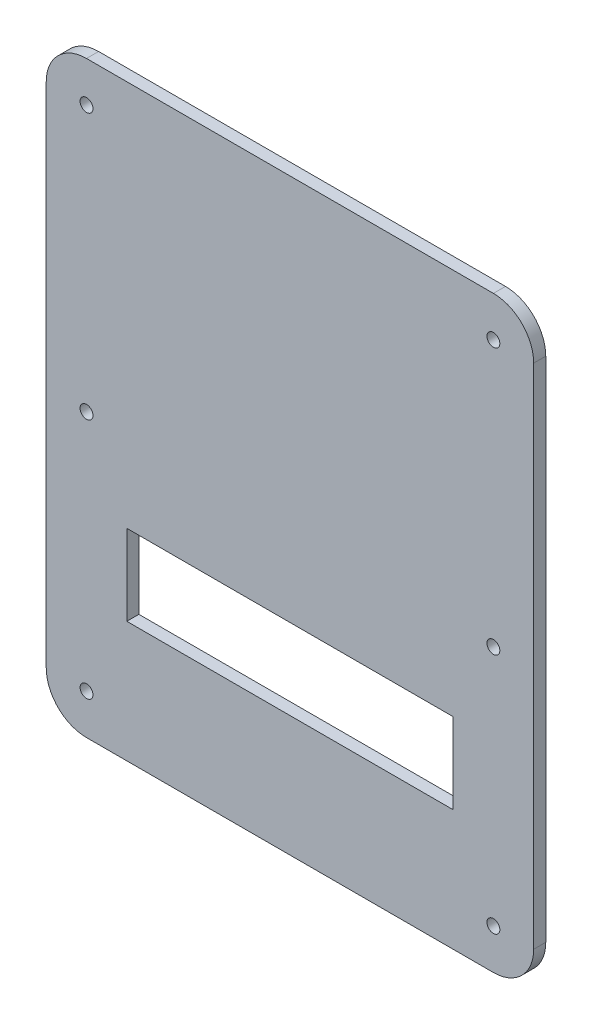
ISO-10303-21;
HEADER;
FILE_DESCRIPTION(('STEP AP214'),'2;1');
FILE_NAME('part.step','',(''),(''),'','','');
FILE_SCHEMA(('AUTOMOTIVE_DESIGN { 1 0 10303 214 1 1 1 1 }'));
ENDSEC;
DATA;
#1=APPLICATION_CONTEXT('core data for automotive mechanical design processes');
#2=APPLICATION_PROTOCOL_DEFINITION('international standard','automotive_design',2000,#1);
#3=PRODUCT_CONTEXT('',#1,'mechanical');
#4=PRODUCT('Part','Part','',(#3));
#5=PRODUCT_RELATED_PRODUCT_CATEGORY('part','',(#4));
#6=PRODUCT_DEFINITION_FORMATION('','',#4);
#7=PRODUCT_DEFINITION_CONTEXT('part definition',#1,'design');
#8=PRODUCT_DEFINITION('design','',#6,#7);
#9=PRODUCT_DEFINITION_SHAPE('','',#8);
#10=(LENGTH_UNIT() NAMED_UNIT(*) SI_UNIT(.MILLI.,.METRE.));
#11=(NAMED_UNIT(*) PLANE_ANGLE_UNIT() SI_UNIT($,.RADIAN.));
#12=(NAMED_UNIT(*) SI_UNIT($,.STERADIAN.) SOLID_ANGLE_UNIT());
#13=UNCERTAINTY_MEASURE_WITH_UNIT(LENGTH_MEASURE(1.E-05),#10,'distance_accuracy_value','');
#14=(GEOMETRIC_REPRESENTATION_CONTEXT(3) GLOBAL_UNCERTAINTY_ASSIGNED_CONTEXT((#13)) GLOBAL_UNIT_ASSIGNED_CONTEXT((#10,
#11,#12)) REPRESENTATION_CONTEXT('',''));
#15=CARTESIAN_POINT('',(0.,0.,0.));
#16=DIRECTION('',(0.,0.,1.));
#17=DIRECTION('',(1.,0.,0.));
#18=AXIS2_PLACEMENT_3D('',#15,#16,#17);
#19=CARTESIAN_POINT('',(0.,0.,3.));
#20=DIRECTION('',(1.,0.,0.));
#21=DIRECTION('',(0.,0.,-1.));
#22=AXIS2_PLACEMENT_3D('',#19,#20,#21);
#23=PLANE('',#22);
#24=DIRECTION('',(0.,-1.,0.));
#25=VECTOR('',#24,1.);
#26=CARTESIAN_POINT('',(0.,0.,0.));
#27=LINE('',#26,#25);
#28=CARTESIAN_POINT('',(0.,136.,0.));
#29=VERTEX_POINT('',#28);
#30=CARTESIAN_POINT('',(0.,10.,0.));
#31=VERTEX_POINT('',#30);
#32=EDGE_CURVE('E191',#29,#31,#27,.T.);
#33=ORIENTED_EDGE('',*,*,#32,.T.);
#34=DIRECTION('',(0.,0.,-1.));
#35=VECTOR('',#34,1.);
#36=CARTESIAN_POINT('',(0.,10.,3.));
#37=LINE('',#36,#35);
#38=CARTESIAN_POINT('',(0.,10.,3.));
#39=VERTEX_POINT('',#38);
#40=EDGE_CURVE('E11',#31,#39,#37,.F.);
#41=ORIENTED_EDGE('',*,*,#40,.T.);
#42=DIRECTION('',(0.,-1.,0.));
#43=VECTOR('',#42,1.);
#44=CARTESIAN_POINT('',(0.,0.,3.));
#45=LINE('',#44,#43);
#46=CARTESIAN_POINT('',(0.,136.,3.));
#47=VERTEX_POINT('',#46);
#48=EDGE_CURVE('E194',#47,#39,#45,.T.);
#49=ORIENTED_EDGE('',*,*,#48,.F.);
#50=DIRECTION('',(0.,0.,-1.));
#51=VECTOR('',#50,1.);
#52=CARTESIAN_POINT('',(0.,136.,3.));
#53=LINE('',#52,#51);
#54=EDGE_CURVE('E41',#47,#29,#53,.T.);
#55=ORIENTED_EDGE('',*,*,#54,.T.);
#56=EDGE_LOOP('',(#33,#41,#49,#55));
#57=FACE_BOUND('',#56,.T.);
#58=ADVANCED_FACE('F33',(#57),#23,.F.);
#59=CARTESIAN_POINT('',(0.,0.,3.));
#60=DIRECTION('',(0.,1.,0.));
#61=DIRECTION('',(0.,0.,1.));
#62=AXIS2_PLACEMENT_3D('',#59,#60,#61);
#63=PLANE('',#62);
#64=DIRECTION('',(1.,0.,0.));
#65=VECTOR('',#64,1.);
#66=CARTESIAN_POINT('',(0.,0.,0.));
#67=LINE('',#66,#65);
#68=CARTESIAN_POINT('',(10.,0.,0.));
#69=VERTEX_POINT('',#68);
#70=CARTESIAN_POINT('',(111.,0.,0.));
#71=VERTEX_POINT('',#70);
#72=EDGE_CURVE('E210',#69,#71,#67,.T.);
#73=ORIENTED_EDGE('',*,*,#72,.T.);
#74=DIRECTION('',(0.,0.,-1.));
#75=VECTOR('',#74,1.);
#76=CARTESIAN_POINT('',(111.,0.,3.));
#77=LINE('',#76,#75);
#78=CARTESIAN_POINT('',(111.,0.,3.));
#79=VERTEX_POINT('',#78);
#80=EDGE_CURVE('E246',#71,#79,#77,.F.);
#81=ORIENTED_EDGE('',*,*,#80,.T.);
#82=DIRECTION('',(1.,0.,0.));
#83=VECTOR('',#82,1.);
#84=CARTESIAN_POINT('',(0.,0.,3.));
#85=LINE('',#84,#83);
#86=CARTESIAN_POINT('',(10.,0.,3.));
#87=VERTEX_POINT('',#86);
#88=EDGE_CURVE('E197',#87,#79,#85,.T.);
#89=ORIENTED_EDGE('',*,*,#88,.F.);
#90=DIRECTION('',(0.,0.,-1.));
#91=VECTOR('',#90,1.);
#92=CARTESIAN_POINT('',(10.,0.,3.));
#93=LINE('',#92,#91);
#94=EDGE_CURVE('E243',#87,#69,#93,.T.);
#95=ORIENTED_EDGE('',*,*,#94,.T.);
#96=EDGE_LOOP('',(#73,#81,#89,#95));
#97=FACE_BOUND('',#96,.T.);
#98=ADVANCED_FACE('F264',(#97),#63,.F.);
#99=CARTESIAN_POINT('',(121.,0.,3.));
#100=DIRECTION('',(-1.,0.,0.));
#101=DIRECTION('',(0.,0.,1.));
#102=AXIS2_PLACEMENT_3D('',#99,#100,#101);
#103=PLANE('',#102);
#104=DIRECTION('',(0.,1.,0.));
#105=VECTOR('',#104,1.);
#106=CARTESIAN_POINT('',(121.,0.,0.));
#107=LINE('',#106,#105);
#108=CARTESIAN_POINT('',(121.,10.,0.));
#109=VERTEX_POINT('',#108);
#110=CARTESIAN_POINT('',(121.,136.,0.));
#111=VERTEX_POINT('',#110);
#112=EDGE_CURVE('E213',#109,#111,#107,.T.);
#113=ORIENTED_EDGE('',*,*,#112,.T.);
#114=DIRECTION('',(0.,0.,-1.));
#115=VECTOR('',#114,1.);
#116=CARTESIAN_POINT('',(121.,136.,3.));
#117=LINE('',#116,#115);
#118=CARTESIAN_POINT('',(121.,136.,3.));
#119=VERTEX_POINT('',#118);
#120=EDGE_CURVE('E233',#111,#119,#117,.F.);
#121=ORIENTED_EDGE('',*,*,#120,.T.);
#122=DIRECTION('',(0.,1.,0.));
#123=VECTOR('',#122,1.);
#124=CARTESIAN_POINT('',(121.,0.,3.));
#125=LINE('',#124,#123);
#126=CARTESIAN_POINT('',(121.,10.,3.));
#127=VERTEX_POINT('',#126);
#128=EDGE_CURVE('E201',#127,#119,#125,.T.);
#129=ORIENTED_EDGE('',*,*,#128,.F.);
#130=DIRECTION('',(0.,0.,-1.));
#131=VECTOR('',#130,1.);
#132=CARTESIAN_POINT('',(121.,10.,3.));
#133=LINE('',#132,#131);
#134=EDGE_CURVE('E230',#127,#109,#133,.T.);
#135=ORIENTED_EDGE('',*,*,#134,.T.);
#136=EDGE_LOOP('',(#113,#121,#129,#135));
#137=FACE_BOUND('',#136,.T.);
#138=ADVANCED_FACE('F275',(#137),#103,.F.);
#139=CARTESIAN_POINT('',(0.,146.,3.));
#140=DIRECTION('',(0.,-1.,0.));
#141=DIRECTION('',(0.,0.,-1.));
#142=AXIS2_PLACEMENT_3D('',#139,#140,#141);
#143=PLANE('',#142);
#144=DIRECTION('',(-1.,0.,0.));
#145=VECTOR('',#144,1.);
#146=CARTESIAN_POINT('',(0.,146.,3.));
#147=LINE('',#146,#145);
#148=CARTESIAN_POINT('',(111.,146.,3.));
#149=VERTEX_POINT('',#148);
#150=CARTESIAN_POINT('',(10.,146.,3.));
#151=VERTEX_POINT('',#150);
#152=EDGE_CURVE('E204',#149,#151,#147,.T.);
#153=ORIENTED_EDGE('',*,*,#152,.F.);
#154=DIRECTION('',(0.,0.,-1.));
#155=VECTOR('',#154,1.);
#156=CARTESIAN_POINT('',(111.,146.,3.));
#157=LINE('',#156,#155);
#158=CARTESIAN_POINT('',(111.,146.,0.));
#159=VERTEX_POINT('',#158);
#160=EDGE_CURVE('E219',#149,#159,#157,.T.);
#161=ORIENTED_EDGE('',*,*,#160,.T.);
#162=DIRECTION('',(-1.,0.,0.));
#163=VECTOR('',#162,1.);
#164=CARTESIAN_POINT('',(0.,146.,0.));
#165=LINE('',#164,#163);
#166=CARTESIAN_POINT('',(10.,146.,0.));
#167=VERTEX_POINT('',#166);
#168=EDGE_CURVE('E198',#159,#167,#165,.T.);
#169=ORIENTED_EDGE('',*,*,#168,.T.);
#170=DIRECTION('',(0.,0.,-1.));
#171=VECTOR('',#170,1.);
#172=CARTESIAN_POINT('',(10.,146.,3.));
#173=LINE('',#172,#171);
#174=EDGE_CURVE('E207',#167,#151,#173,.F.);
#175=ORIENTED_EDGE('',*,*,#174,.T.);
#176=EDGE_LOOP('',(#153,#161,#169,#175));
#177=FACE_BOUND('',#176,.T.);
#178=ADVANCED_FACE('F283',(#177),#143,.F.);
#179=CARTESIAN_POINT('',(0.,0.,3.));
#180=DIRECTION('',(0.,0.,-1.));
#181=DIRECTION('',(-1.,0.,0.));
#182=AXIS2_PLACEMENT_3D('',#179,#180,#181);
#183=PLANE('',#182);
#184=DIRECTION('',(1.,0.,0.));
#185=VECTOR('',#184,1.);
#186=CARTESIAN_POINT('',(20.0000000000051,30.0000000000006,3.));
#187=LINE('',#186,#185);
#188=CARTESIAN_POINT('',(20.0000000000051,30.0000000000006,3.));
#189=VERTEX_POINT('',#188);
#190=CARTESIAN_POINT('',(101.,30.0000000000006,3.));
#191=VERTEX_POINT('',#190);
#192=EDGE_CURVE('E148',#189,#191,#187,.T.);
#193=ORIENTED_EDGE('',*,*,#192,.F.);
#194=DIRECTION('',(0.,-1.,0.));
#195=VECTOR('',#194,1.);
#196=CARTESIAN_POINT('',(20.0000000000051,50.0000000000057,3.));
#197=LINE('',#196,#195);
#198=CARTESIAN_POINT('',(20.0000000000051,50.0000000000057,3.));
#199=VERTEX_POINT('',#198);
#200=EDGE_CURVE('E48',#199,#189,#197,.T.);
#201=ORIENTED_EDGE('',*,*,#200,.F.);
#202=DIRECTION('',(-1.,0.,0.));
#203=VECTOR('',#202,1.);
#204=CARTESIAN_POINT('',(20.0000000000051,50.0000000000057,3.));
#205=LINE('',#204,#203);
#206=CARTESIAN_POINT('',(101.,50.0000000000057,3.));
#207=VERTEX_POINT('',#206);
#208=EDGE_CURVE('E139',#207,#199,#205,.T.);
#209=ORIENTED_EDGE('',*,*,#208,.F.);
#210=DIRECTION('',(0.,1.,0.));
#211=VECTOR('',#210,1.);
#212=CARTESIAN_POINT('',(101.,50.0000000000057,3.));
#213=LINE('',#212,#211);
#214=EDGE_CURVE('E142',#191,#207,#213,.T.);
#215=ORIENTED_EDGE('',*,*,#214,.F.);
#216=EDGE_LOOP('',(#193,#201,#209,#215));
#217=FACE_BOUND('',#216,.T.);
#218=CARTESIAN_POINT('',(9.99999999999545,9.99999999999545,3.));
#219=DIRECTION('',(0.,0.,1.));
#220=DIRECTION('',(1.,0.,0.));
#221=AXIS2_PLACEMENT_3D('',#218,#219,#220);
#222=CIRCLE('',#221,1.6);
#223=CARTESIAN_POINT('',(11.5999999999955,9.99999999999545,3.));
#224=VERTEX_POINT('',#223);
#225=EDGE_CURVE('E154',#224,#224,#222,.T.);
#226=ORIENTED_EDGE('',*,*,#225,.F.);
#227=EDGE_LOOP('',(#226));
#228=FACE_BOUND('',#227,.T.);
#229=CARTESIAN_POINT('',(110.999999999995,9.99999999999545,3.));
#230=DIRECTION('',(0.,0.,1.));
#231=DIRECTION('',(1.,0.,0.));
#232=AXIS2_PLACEMENT_3D('',#229,#230,#231);
#233=CIRCLE('',#232,1.6);
#234=CARTESIAN_POINT('',(112.599999999995,9.99999999999545,3.));
#235=VERTEX_POINT('',#234);
#236=EDGE_CURVE('E161',#235,#235,#233,.T.);
#237=ORIENTED_EDGE('',*,*,#236,.F.);
#238=EDGE_LOOP('',(#237));
#239=FACE_BOUND('',#238,.T.);
#240=CARTESIAN_POINT('',(110.999999999995,69.9999999999966,3.));
#241=DIRECTION('',(0.,0.,1.));
#242=DIRECTION('',(1.,0.,0.));
#243=AXIS2_PLACEMENT_3D('',#240,#241,#242);
#244=CIRCLE('',#243,1.60000000000001);
#245=CARTESIAN_POINT('',(112.599999999995,69.9999999999966,3.));
#246=VERTEX_POINT('',#245);
#247=EDGE_CURVE('E167',#246,#246,#244,.T.);
#248=ORIENTED_EDGE('',*,*,#247,.F.);
#249=EDGE_LOOP('',(#248));
#250=FACE_BOUND('',#249,.T.);
#251=CARTESIAN_POINT('',(110.999999999995,135.999999999998,3.));
#252=DIRECTION('',(0.,0.,1.));
#253=DIRECTION('',(1.,0.,0.));
#254=AXIS2_PLACEMENT_3D('',#251,#252,#253);
#255=CIRCLE('',#254,1.6);
#256=CARTESIAN_POINT('',(112.599999999995,135.999999999998,3.));
#257=VERTEX_POINT('',#256);
#258=EDGE_CURVE('E173',#257,#257,#255,.T.);
#259=ORIENTED_EDGE('',*,*,#258,.F.);
#260=EDGE_LOOP('',(#259));
#261=FACE_BOUND('',#260,.T.);
#262=CARTESIAN_POINT('',(10.,70.0352041959604,3.));
#263=DIRECTION('',(0.,0.,1.));
#264=DIRECTION('',(1.,0.,0.));
#265=AXIS2_PLACEMENT_3D('',#262,#263,#264);
#266=CIRCLE('',#265,1.6);
#267=CARTESIAN_POINT('',(11.6,70.0352041959604,3.));
#268=VERTEX_POINT('',#267);
#269=EDGE_CURVE('E179',#268,#268,#266,.T.);
#270=ORIENTED_EDGE('',*,*,#269,.F.);
#271=EDGE_LOOP('',(#270));
#272=FACE_BOUND('',#271,.T.);
#273=CARTESIAN_POINT('',(10.,136.,3.));
#274=DIRECTION('',(0.,0.,1.));
#275=DIRECTION('',(1.,0.,0.));
#276=AXIS2_PLACEMENT_3D('',#273,#274,#275);
#277=CIRCLE('',#276,1.6);
#278=CARTESIAN_POINT('',(11.6,136.,3.));
#279=VERTEX_POINT('',#278);
#280=EDGE_CURVE('E185',#279,#279,#277,.T.);
#281=ORIENTED_EDGE('',*,*,#280,.F.);
#282=EDGE_LOOP('',(#281));
#283=FACE_BOUND('',#282,.T.);
#284=ORIENTED_EDGE('',*,*,#128,.T.);
#285=CARTESIAN_POINT('',(111.,136.,3.));
#286=DIRECTION('',(0.,0.,-1.));
#287=DIRECTION('',(-1.,0.,0.));
#288=AXIS2_PLACEMENT_3D('',#285,#286,#287);
#289=CIRCLE('',#288,10.);
#290=EDGE_CURVE('E241',#119,#149,#289,.F.);
#291=ORIENTED_EDGE('',*,*,#290,.T.);
#292=ORIENTED_EDGE('',*,*,#152,.T.);
#293=CARTESIAN_POINT('',(10.,136.,3.));
#294=DIRECTION('',(0.,0.,-1.));
#295=DIRECTION('',(-1.,0.,0.));
#296=AXIS2_PLACEMENT_3D('',#293,#294,#295);
#297=CIRCLE('',#296,10.);
#298=EDGE_CURVE('E235',#151,#47,#297,.F.);
#299=ORIENTED_EDGE('',*,*,#298,.T.);
#300=ORIENTED_EDGE('',*,*,#48,.T.);
#301=CARTESIAN_POINT('',(10.,10.,3.));
#302=DIRECTION('',(0.,0.,-1.));
#303=DIRECTION('',(-1.,0.,0.));
#304=AXIS2_PLACEMENT_3D('',#301,#302,#303);
#305=CIRCLE('',#304,10.);
#306=EDGE_CURVE('E237',#39,#87,#305,.F.);
#307=ORIENTED_EDGE('',*,*,#306,.T.);
#308=ORIENTED_EDGE('',*,*,#88,.T.);
#309=CARTESIAN_POINT('',(111.,10.,3.));
#310=DIRECTION('',(0.,0.,-1.));
#311=DIRECTION('',(-1.,0.,0.));
#312=AXIS2_PLACEMENT_3D('',#309,#310,#311);
#313=CIRCLE('',#312,10.);
#314=EDGE_CURVE('E239',#79,#127,#313,.F.);
#315=ORIENTED_EDGE('',*,*,#314,.T.);
#316=EDGE_LOOP('',(#284,#291,#292,#299,#300,#307,#308,#315));
#317=FACE_BOUND('',#316,.T.);
#318=ADVANCED_FACE('F268',(#217,#228,#239,#250,#261,#272,#283,#317),#183,.F.);
#319=CARTESIAN_POINT('',(0.,0.,0.));
#320=DIRECTION('',(0.,0.,-1.));
#321=DIRECTION('',(-1.,0.,0.));
#322=AXIS2_PLACEMENT_3D('',#319,#320,#321);
#323=PLANE('',#322);
#324=DIRECTION('',(0.,-1.,0.));
#325=VECTOR('',#324,1.);
#326=CARTESIAN_POINT('',(20.0000000000051,50.0000000000057,0.));
#327=LINE('',#326,#325);
#328=CARTESIAN_POINT('',(20.0000000000051,50.0000000000057,0.));
#329=VERTEX_POINT('',#328);
#330=CARTESIAN_POINT('',(20.0000000000051,30.0000000000006,0.));
#331=VERTEX_POINT('',#330);
#332=EDGE_CURVE('E123',#329,#331,#327,.T.);
#333=ORIENTED_EDGE('',*,*,#332,.T.);
#334=DIRECTION('',(1.,0.,0.));
#335=VECTOR('',#334,1.);
#336=CARTESIAN_POINT('',(20.0000000000051,30.0000000000006,0.));
#337=LINE('',#336,#335);
#338=CARTESIAN_POINT('',(101.,30.0000000000006,0.));
#339=VERTEX_POINT('',#338);
#340=EDGE_CURVE('E132',#331,#339,#337,.T.);
#341=ORIENTED_EDGE('',*,*,#340,.T.);
#342=DIRECTION('',(0.,1.,0.));
#343=VECTOR('',#342,1.);
#344=CARTESIAN_POINT('',(101.,50.0000000000057,0.));
#345=LINE('',#344,#343);
#346=CARTESIAN_POINT('',(101.,50.0000000000057,0.));
#347=VERTEX_POINT('',#346);
#348=EDGE_CURVE('E56',#339,#347,#345,.T.);
#349=ORIENTED_EDGE('',*,*,#348,.T.);
#350=DIRECTION('',(-1.,0.,0.));
#351=VECTOR('',#350,1.);
#352=CARTESIAN_POINT('',(20.0000000000051,50.0000000000057,0.));
#353=LINE('',#352,#351);
#354=EDGE_CURVE('E129',#347,#329,#353,.T.);
#355=ORIENTED_EDGE('',*,*,#354,.T.);
#356=EDGE_LOOP('',(#333,#341,#349,#355));
#357=FACE_BOUND('',#356,.T.);
#358=CARTESIAN_POINT('',(9.99999999999545,9.99999999999545,0.));
#359=DIRECTION('',(0.,0.,1.));
#360=DIRECTION('',(1.,0.,0.));
#361=AXIS2_PLACEMENT_3D('',#358,#359,#360);
#362=CIRCLE('',#361,1.6);
#363=CARTESIAN_POINT('',(11.5999999999955,9.99999999999545,0.));
#364=VERTEX_POINT('',#363);
#365=EDGE_CURVE('E158',#364,#364,#362,.T.);
#366=ORIENTED_EDGE('',*,*,#365,.T.);
#367=EDGE_LOOP('',(#366));
#368=FACE_BOUND('',#367,.T.);
#369=CARTESIAN_POINT('',(110.999999999995,9.99999999999545,0.));
#370=DIRECTION('',(0.,0.,1.));
#371=DIRECTION('',(1.,0.,0.));
#372=AXIS2_PLACEMENT_3D('',#369,#370,#371);
#373=CIRCLE('',#372,1.6);
#374=CARTESIAN_POINT('',(112.599999999995,9.99999999999545,0.));
#375=VERTEX_POINT('',#374);
#376=EDGE_CURVE('E164',#375,#375,#373,.T.);
#377=ORIENTED_EDGE('',*,*,#376,.T.);
#378=EDGE_LOOP('',(#377));
#379=FACE_BOUND('',#378,.T.);
#380=CARTESIAN_POINT('',(110.999999999995,69.9999999999966,0.));
#381=DIRECTION('',(0.,0.,1.));
#382=DIRECTION('',(1.,0.,0.));
#383=AXIS2_PLACEMENT_3D('',#380,#381,#382);
#384=CIRCLE('',#383,1.60000000000001);
#385=CARTESIAN_POINT('',(112.599999999995,69.9999999999966,0.));
#386=VERTEX_POINT('',#385);
#387=EDGE_CURVE('E170',#386,#386,#384,.T.);
#388=ORIENTED_EDGE('',*,*,#387,.T.);
#389=EDGE_LOOP('',(#388));
#390=FACE_BOUND('',#389,.T.);
#391=CARTESIAN_POINT('',(110.999999999995,135.999999999998,0.));
#392=DIRECTION('',(0.,0.,1.));
#393=DIRECTION('',(1.,0.,0.));
#394=AXIS2_PLACEMENT_3D('',#391,#392,#393);
#395=CIRCLE('',#394,1.6);
#396=CARTESIAN_POINT('',(112.599999999995,135.999999999998,0.));
#397=VERTEX_POINT('',#396);
#398=EDGE_CURVE('E176',#397,#397,#395,.T.);
#399=ORIENTED_EDGE('',*,*,#398,.T.);
#400=EDGE_LOOP('',(#399));
#401=FACE_BOUND('',#400,.T.);
#402=CARTESIAN_POINT('',(10.,70.0352041959604,0.));
#403=DIRECTION('',(0.,0.,1.));
#404=DIRECTION('',(1.,0.,0.));
#405=AXIS2_PLACEMENT_3D('',#402,#403,#404);
#406=CIRCLE('',#405,1.6);
#407=CARTESIAN_POINT('',(11.6,70.0352041959604,0.));
#408=VERTEX_POINT('',#407);
#409=EDGE_CURVE('E182',#408,#408,#406,.T.);
#410=ORIENTED_EDGE('',*,*,#409,.T.);
#411=EDGE_LOOP('',(#410));
#412=FACE_BOUND('',#411,.T.);
#413=CARTESIAN_POINT('',(10.,136.,0.));
#414=DIRECTION('',(0.,0.,1.));
#415=DIRECTION('',(1.,0.,0.));
#416=AXIS2_PLACEMENT_3D('',#413,#414,#415);
#417=CIRCLE('',#416,1.6);
#418=CARTESIAN_POINT('',(11.6,136.,0.));
#419=VERTEX_POINT('',#418);
#420=EDGE_CURVE('E188',#419,#419,#417,.T.);
#421=ORIENTED_EDGE('',*,*,#420,.T.);
#422=EDGE_LOOP('',(#421));
#423=FACE_BOUND('',#422,.T.);
#424=ORIENTED_EDGE('',*,*,#168,.F.);
#425=CARTESIAN_POINT('',(111.,136.,0.));
#426=DIRECTION('',(0.,0.,-1.));
#427=DIRECTION('',(-1.,0.,0.));
#428=AXIS2_PLACEMENT_3D('',#425,#426,#427);
#429=CIRCLE('',#428,10.);
#430=EDGE_CURVE('E228',#159,#111,#429,.T.);
#431=ORIENTED_EDGE('',*,*,#430,.T.);
#432=ORIENTED_EDGE('',*,*,#112,.F.);
#433=CARTESIAN_POINT('',(111.,10.,0.));
#434=DIRECTION('',(0.,0.,-1.));
#435=DIRECTION('',(-1.,0.,0.));
#436=AXIS2_PLACEMENT_3D('',#433,#434,#435);
#437=CIRCLE('',#436,10.);
#438=EDGE_CURVE('E226',#109,#71,#437,.T.);
#439=ORIENTED_EDGE('',*,*,#438,.T.);
#440=ORIENTED_EDGE('',*,*,#72,.F.);
#441=CARTESIAN_POINT('',(10.,10.,0.));
#442=DIRECTION('',(0.,0.,-1.));
#443=DIRECTION('',(-1.,0.,0.));
#444=AXIS2_PLACEMENT_3D('',#441,#442,#443);
#445=CIRCLE('',#444,10.);
#446=EDGE_CURVE('E224',#69,#31,#445,.T.);
#447=ORIENTED_EDGE('',*,*,#446,.T.);
#448=ORIENTED_EDGE('',*,*,#32,.F.);
#449=CARTESIAN_POINT('',(10.,136.,0.));
#450=DIRECTION('',(0.,0.,-1.));
#451=DIRECTION('',(-1.,0.,0.));
#452=AXIS2_PLACEMENT_3D('',#449,#450,#451);
#453=CIRCLE('',#452,10.);
#454=EDGE_CURVE('E222',#29,#167,#453,.T.);
#455=ORIENTED_EDGE('',*,*,#454,.T.);
#456=EDGE_LOOP('',(#424,#431,#432,#439,#440,#447,#448,#455));
#457=FACE_BOUND('',#456,.T.);
#458=ADVANCED_FACE('F136',(#357,#368,#379,#390,#401,#412,#423,#457),#323,.T.);
#459=CARTESIAN_POINT('',(111.,136.,3.));
#460=DIRECTION('',(0.,0.,-1.));
#461=DIRECTION('',(-1.,0.,0.));
#462=AXIS2_PLACEMENT_3D('',#459,#460,#461);
#463=CYLINDRICAL_SURFACE('',#462,10.);
#464=ORIENTED_EDGE('',*,*,#290,.F.);
#465=ORIENTED_EDGE('',*,*,#120,.F.);
#466=ORIENTED_EDGE('',*,*,#430,.F.);
#467=ORIENTED_EDGE('',*,*,#160,.F.);
#468=EDGE_LOOP('',(#464,#465,#466,#467));
#469=FACE_BOUND('',#468,.T.);
#470=ADVANCED_FACE('F280',(#469),#463,.T.);
#471=CARTESIAN_POINT('',(111.,10.,3.));
#472=DIRECTION('',(0.,0.,-1.));
#473=DIRECTION('',(-1.,0.,0.));
#474=AXIS2_PLACEMENT_3D('',#471,#472,#473);
#475=CYLINDRICAL_SURFACE('',#474,10.);
#476=ORIENTED_EDGE('',*,*,#314,.F.);
#477=ORIENTED_EDGE('',*,*,#80,.F.);
#478=ORIENTED_EDGE('',*,*,#438,.F.);
#479=ORIENTED_EDGE('',*,*,#134,.F.);
#480=EDGE_LOOP('',(#476,#477,#478,#479));
#481=FACE_BOUND('',#480,.T.);
#482=ADVANCED_FACE('F272',(#481),#475,.T.);
#483=CARTESIAN_POINT('',(10.,10.,3.));
#484=DIRECTION('',(0.,0.,-1.));
#485=DIRECTION('',(-1.,0.,0.));
#486=AXIS2_PLACEMENT_3D('',#483,#484,#485);
#487=CYLINDRICAL_SURFACE('',#486,10.);
#488=ORIENTED_EDGE('',*,*,#306,.F.);
#489=ORIENTED_EDGE('',*,*,#40,.F.);
#490=ORIENTED_EDGE('',*,*,#446,.F.);
#491=ORIENTED_EDGE('',*,*,#94,.F.);
#492=EDGE_LOOP('',(#488,#489,#490,#491));
#493=FACE_BOUND('',#492,.T.);
#494=ADVANCED_FACE('F261',(#493),#487,.T.);
#495=CARTESIAN_POINT('',(10.,136.,3.));
#496=DIRECTION('',(0.,0.,-1.));
#497=DIRECTION('',(-1.,0.,0.));
#498=AXIS2_PLACEMENT_3D('',#495,#496,#497);
#499=CYLINDRICAL_SURFACE('',#498,10.);
#500=ORIENTED_EDGE('',*,*,#298,.F.);
#501=ORIENTED_EDGE('',*,*,#174,.F.);
#502=ORIENTED_EDGE('',*,*,#454,.F.);
#503=ORIENTED_EDGE('',*,*,#54,.F.);
#504=EDGE_LOOP('',(#500,#501,#502,#503));
#505=FACE_BOUND('',#504,.T.);
#506=ADVANCED_FACE('F35',(#505),#499,.T.);
#507=CARTESIAN_POINT('',(10.,136.,0.));
#508=DIRECTION('',(0.,0.,1.));
#509=DIRECTION('',(1.,0.,0.));
#510=AXIS2_PLACEMENT_3D('',#507,#508,#509);
#511=CYLINDRICAL_SURFACE('',#510,1.6);
#512=ORIENTED_EDGE('',*,*,#420,.F.);
#513=EDGE_LOOP('',(#512));
#514=FACE_BOUND('',#513,.T.);
#515=ORIENTED_EDGE('',*,*,#280,.T.);
#516=EDGE_LOOP('',(#515));
#517=FACE_BOUND('',#516,.T.);
#518=ADVANCED_FACE('F286',(#514,#517),#511,.F.);
#519=CARTESIAN_POINT('',(10.,70.0352041959604,0.));
#520=DIRECTION('',(0.,0.,1.));
#521=DIRECTION('',(1.,0.,0.));
#522=AXIS2_PLACEMENT_3D('',#519,#520,#521);
#523=CYLINDRICAL_SURFACE('',#522,1.6);
#524=ORIENTED_EDGE('',*,*,#409,.F.);
#525=EDGE_LOOP('',(#524));
#526=FACE_BOUND('',#525,.T.);
#527=ORIENTED_EDGE('',*,*,#269,.T.);
#528=EDGE_LOOP('',(#527));
#529=FACE_BOUND('',#528,.T.);
#530=ADVANCED_FACE('F291',(#526,#529),#523,.F.);
#531=CARTESIAN_POINT('',(110.999999999995,135.999999999998,0.));
#532=DIRECTION('',(0.,0.,1.));
#533=DIRECTION('',(1.,0.,0.));
#534=AXIS2_PLACEMENT_3D('',#531,#532,#533);
#535=CYLINDRICAL_SURFACE('',#534,1.6);
#536=ORIENTED_EDGE('',*,*,#398,.F.);
#537=EDGE_LOOP('',(#536));
#538=FACE_BOUND('',#537,.T.);
#539=ORIENTED_EDGE('',*,*,#258,.T.);
#540=EDGE_LOOP('',(#539));
#541=FACE_BOUND('',#540,.T.);
#542=ADVANCED_FACE('F333',(#538,#541),#535,.F.);
#543=CARTESIAN_POINT('',(110.999999999995,69.9999999999966,0.));
#544=DIRECTION('',(0.,0.,1.));
#545=DIRECTION('',(1.,0.,0.));
#546=AXIS2_PLACEMENT_3D('',#543,#544,#545);
#547=CYLINDRICAL_SURFACE('',#546,1.60000000000001);
#548=ORIENTED_EDGE('',*,*,#387,.F.);
#549=EDGE_LOOP('',(#548));
#550=FACE_BOUND('',#549,.T.);
#551=ORIENTED_EDGE('',*,*,#247,.T.);
#552=EDGE_LOOP('',(#551));
#553=FACE_BOUND('',#552,.T.);
#554=ADVANCED_FACE('F343',(#550,#553),#547,.F.);
#555=CARTESIAN_POINT('',(110.999999999995,9.99999999999545,0.));
#556=DIRECTION('',(0.,0.,1.));
#557=DIRECTION('',(1.,0.,0.));
#558=AXIS2_PLACEMENT_3D('',#555,#556,#557);
#559=CYLINDRICAL_SURFACE('',#558,1.6);
#560=ORIENTED_EDGE('',*,*,#376,.F.);
#561=EDGE_LOOP('',(#560));
#562=FACE_BOUND('',#561,.T.);
#563=ORIENTED_EDGE('',*,*,#236,.T.);
#564=EDGE_LOOP('',(#563));
#565=FACE_BOUND('',#564,.T.);
#566=ADVANCED_FACE('F353',(#562,#565),#559,.F.);
#567=CARTESIAN_POINT('',(9.99999999999545,9.99999999999545,0.));
#568=DIRECTION('',(0.,0.,1.));
#569=DIRECTION('',(1.,0.,0.));
#570=AXIS2_PLACEMENT_3D('',#567,#568,#569);
#571=CYLINDRICAL_SURFACE('',#570,1.6);
#572=ORIENTED_EDGE('',*,*,#365,.F.);
#573=EDGE_LOOP('',(#572));
#574=FACE_BOUND('',#573,.T.);
#575=ORIENTED_EDGE('',*,*,#225,.T.);
#576=EDGE_LOOP('',(#575));
#577=FACE_BOUND('',#576,.T.);
#578=ADVANCED_FACE('F363',(#574,#577),#571,.F.);
#579=CARTESIAN_POINT('',(20.0000000000051,50.0000000000057,0.));
#580=DIRECTION('',(-1.,0.,0.));
#581=DIRECTION('',(0.,0.,1.));
#582=AXIS2_PLACEMENT_3D('',#579,#580,#581);
#583=PLANE('',#582);
#584=ORIENTED_EDGE('',*,*,#200,.T.);
#585=DIRECTION('',(0.,0.,1.));
#586=VECTOR('',#585,1.);
#587=CARTESIAN_POINT('',(20.0000000000051,30.0000000000006,0.));
#588=LINE('',#587,#586);
#589=EDGE_CURVE('E119',#331,#189,#588,.T.);
#590=ORIENTED_EDGE('',*,*,#589,.F.);
#591=ORIENTED_EDGE('',*,*,#332,.F.);
#592=DIRECTION('',(0.,0.,1.));
#593=VECTOR('',#592,1.);
#594=CARTESIAN_POINT('',(20.0000000000051,50.0000000000057,0.));
#595=LINE('',#594,#593);
#596=EDGE_CURVE('E152',#329,#199,#595,.T.);
#597=ORIENTED_EDGE('',*,*,#596,.T.);
#598=EDGE_LOOP('',(#584,#590,#591,#597));
#599=FACE_BOUND('',#598,.T.);
#600=ADVANCED_FACE('F121',(#599),#583,.F.);
#601=CARTESIAN_POINT('',(20.0000000000051,50.0000000000057,0.));
#602=DIRECTION('',(0.,1.,0.));
#603=DIRECTION('',(0.,0.,1.));
#604=AXIS2_PLACEMENT_3D('',#601,#602,#603);
#605=PLANE('',#604);
#606=ORIENTED_EDGE('',*,*,#208,.T.);
#607=ORIENTED_EDGE('',*,*,#596,.F.);
#608=ORIENTED_EDGE('',*,*,#354,.F.);
#609=DIRECTION('',(0.,0.,1.));
#610=VECTOR('',#609,1.);
#611=CARTESIAN_POINT('',(101.,50.0000000000057,0.));
#612=LINE('',#611,#610);
#613=EDGE_CURVE('E155',#347,#207,#612,.T.);
#614=ORIENTED_EDGE('',*,*,#613,.T.);
#615=EDGE_LOOP('',(#606,#607,#608,#614));
#616=FACE_BOUND('',#615,.T.);
#617=ADVANCED_FACE('F401',(#616),#605,.F.);
#618=CARTESIAN_POINT('',(101.,50.0000000000057,0.));
#619=DIRECTION('',(1.,0.,0.));
#620=DIRECTION('',(0.,0.,-1.));
#621=AXIS2_PLACEMENT_3D('',#618,#619,#620);
#622=PLANE('',#621);
#623=ORIENTED_EDGE('',*,*,#214,.T.);
#624=ORIENTED_EDGE('',*,*,#613,.F.);
#625=ORIENTED_EDGE('',*,*,#348,.F.);
#626=DIRECTION('',(0.,0.,1.));
#627=VECTOR('',#626,1.);
#628=CARTESIAN_POINT('',(101.,30.0000000000006,0.));
#629=LINE('',#628,#627);
#630=EDGE_CURVE('E128',#339,#191,#629,.T.);
#631=ORIENTED_EDGE('',*,*,#630,.T.);
#632=EDGE_LOOP('',(#623,#624,#625,#631));
#633=FACE_BOUND('',#632,.T.);
#634=ADVANCED_FACE('F410',(#633),#622,.F.);
#635=CARTESIAN_POINT('',(20.0000000000051,30.0000000000006,0.));
#636=DIRECTION('',(0.,-1.,0.));
#637=DIRECTION('',(0.,0.,-1.));
#638=AXIS2_PLACEMENT_3D('',#635,#636,#637);
#639=PLANE('',#638);
#640=ORIENTED_EDGE('',*,*,#192,.T.);
#641=ORIENTED_EDGE('',*,*,#630,.F.);
#642=ORIENTED_EDGE('',*,*,#340,.F.);
#643=ORIENTED_EDGE('',*,*,#589,.T.);
#644=EDGE_LOOP('',(#640,#641,#642,#643));
#645=FACE_BOUND('',#644,.T.);
#646=ADVANCED_FACE('F133',(#645),#639,.F.);
#647=CLOSED_SHELL('',(#58,#98,#138,#178,#318,#458,#470,#482,#494,#506,#518,#530,#542,#554,#566,
#578,#600,#617,#634,#646));
#648=MANIFOLD_SOLID_BREP('B2',#647);
#649=ADVANCED_BREP_SHAPE_REPRESENTATION('',(#18,#648),#14);
#650=SHAPE_DEFINITION_REPRESENTATION(#9,#649);
ENDSEC;
END-ISO-10303-21;
